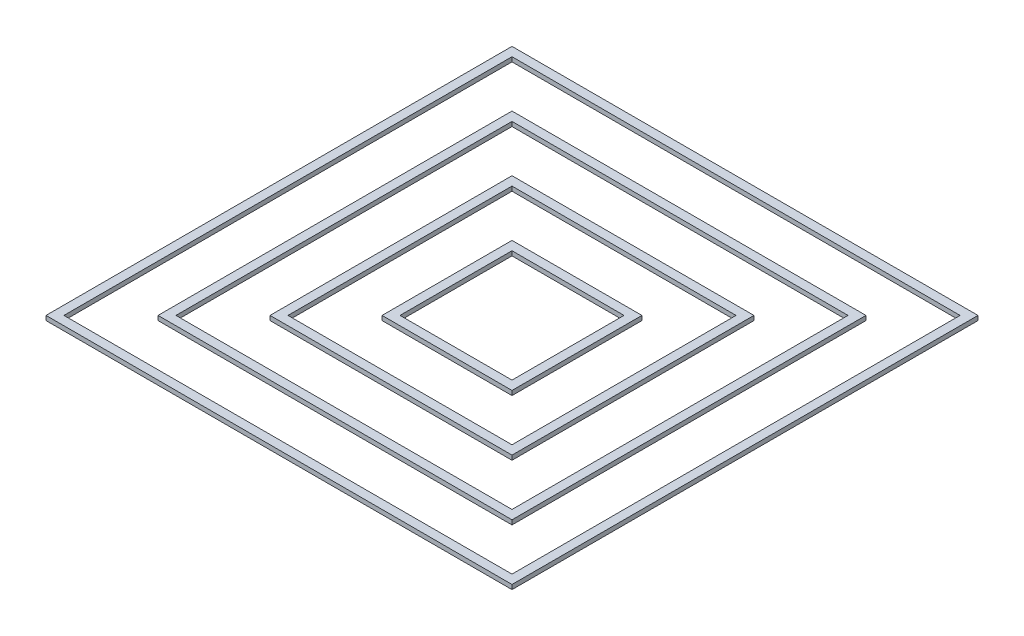
ISO-10303-21;
HEADER;
FILE_DESCRIPTION(('STEP AP214'),'2;1');
FILE_NAME('part.step','',(''),(''),'','','');
FILE_SCHEMA(('AUTOMOTIVE_DESIGN { 1 0 10303 214 1 1 1 1 }'));
ENDSEC;
DATA;
#1=APPLICATION_CONTEXT('core data for automotive mechanical design processes');
#2=APPLICATION_PROTOCOL_DEFINITION('international standard','automotive_design',2000,#1);
#3=PRODUCT_CONTEXT('',#1,'mechanical');
#4=PRODUCT('Part','Part','',(#3));
#5=PRODUCT_RELATED_PRODUCT_CATEGORY('part','',(#4));
#6=PRODUCT_DEFINITION_FORMATION('','',#4);
#7=PRODUCT_DEFINITION_CONTEXT('part definition',#1,'design');
#8=PRODUCT_DEFINITION('design','',#6,#7);
#9=PRODUCT_DEFINITION_SHAPE('','',#8);
#10=(LENGTH_UNIT() NAMED_UNIT(*) SI_UNIT(.MILLI.,.METRE.));
#11=(NAMED_UNIT(*) PLANE_ANGLE_UNIT() SI_UNIT($,.RADIAN.));
#12=(NAMED_UNIT(*) SI_UNIT($,.STERADIAN.) SOLID_ANGLE_UNIT());
#13=UNCERTAINTY_MEASURE_WITH_UNIT(LENGTH_MEASURE(1.E-05),#10,'distance_accuracy_value','');
#14=(GEOMETRIC_REPRESENTATION_CONTEXT(3) GLOBAL_UNCERTAINTY_ASSIGNED_CONTEXT((#13)) GLOBAL_UNIT_ASSIGNED_CONTEXT((#10,
#11,#12)) REPRESENTATION_CONTEXT('',''));
#15=CARTESIAN_POINT('',(0.,0.,0.));
#16=DIRECTION('',(0.,0.,1.));
#17=DIRECTION('',(1.,0.,0.));
#18=AXIS2_PLACEMENT_3D('',#15,#16,#17);
#19=CARTESIAN_POINT('',(0.,2.,0.));
#20=DIRECTION('',(0.,1.,0.));
#21=DIRECTION('',(0.,0.,1.));
#22=AXIS2_PLACEMENT_3D('',#19,#20,#21);
#23=PLANE('',#22);
#24=DIRECTION('',(0.,0.,1.));
#25=VECTOR('',#24,1.);
#26=CARTESIAN_POINT('',(-14.8676207513417,2.,15.4293381037567));
#27=LINE('',#26,#25);
#28=CARTESIAN_POINT('',(-14.8676207513417,2.,11.4293381037567));
#29=VERTEX_POINT('',#28);
#30=CARTESIAN_POINT('',(-14.8676207513417,2.,69.4293381037567));
#31=VERTEX_POINT('',#30);
#32=EDGE_CURVE('E825',#29,#31,#27,.T.);
#33=ORIENTED_EDGE('',*,*,#32,.T.);
#34=DIRECTION('',(1.,0.,0.));
#35=VECTOR('',#34,1.);
#36=CARTESIAN_POINT('',(-10.8676207513417,2.,69.4293381037567));
#37=LINE('',#36,#35);
#38=CARTESIAN_POINT('',(43.1323792486584,2.,69.4293381037567));
#39=VERTEX_POINT('',#38);
#40=EDGE_CURVE('E829',#31,#39,#37,.T.);
#41=ORIENTED_EDGE('',*,*,#40,.T.);
#42=DIRECTION('',(0.,0.,1.));
#43=VECTOR('',#42,1.);
#44=CARTESIAN_POINT('',(43.1323792486583,2.,15.4293381037567));
#45=LINE('',#44,#43);
#46=CARTESIAN_POINT('',(43.1323792486583,2.,11.4293381037567));
#47=VERTEX_POINT('',#46);
#48=EDGE_CURVE('E831',#47,#39,#45,.T.);
#49=ORIENTED_EDGE('',*,*,#48,.F.);
#50=DIRECTION('',(1.,0.,0.));
#51=VECTOR('',#50,1.);
#52=CARTESIAN_POINT('',(-10.8676207513417,2.,11.4293381037567));
#53=LINE('',#52,#51);
#54=EDGE_CURVE('E834',#29,#47,#53,.T.);
#55=ORIENTED_EDGE('',*,*,#54,.F.);
#56=EDGE_LOOP('',(#33,#41,#49,#55));
#57=FACE_BOUND('',#56,.T.);
#58=DIRECTION('',(1.,0.,0.));
#59=VECTOR('',#58,1.);
#60=CARTESIAN_POINT('',(-10.8676207513417,2.,65.4293381037567));
#61=LINE('',#60,#59);
#62=CARTESIAN_POINT('',(-10.8676207513417,2.,65.4293381037567));
#63=VERTEX_POINT('',#62);
#64=CARTESIAN_POINT('',(39.1323792486583,2.,65.4293381037567));
#65=VERTEX_POINT('',#64);
#66=EDGE_CURVE('E752',#63,#65,#61,.T.);
#67=ORIENTED_EDGE('',*,*,#66,.F.);
#68=DIRECTION('',(0.,0.,1.));
#69=VECTOR('',#68,1.);
#70=CARTESIAN_POINT('',(-10.8676207513417,2.,15.4293381037567));
#71=LINE('',#70,#69);
#72=CARTESIAN_POINT('',(-10.8676207513417,2.,15.4293381037567));
#73=VERTEX_POINT('',#72);
#74=EDGE_CURVE('E726',#73,#63,#71,.T.);
#75=ORIENTED_EDGE('',*,*,#74,.F.);
#76=DIRECTION('',(1.,0.,0.));
#77=VECTOR('',#76,1.);
#78=CARTESIAN_POINT('',(-10.8676207513417,2.,15.4293381037567));
#79=LINE('',#78,#77);
#80=CARTESIAN_POINT('',(39.1323792486583,2.,15.4293381037567));
#81=VERTEX_POINT('',#80);
#82=EDGE_CURVE('E798',#73,#81,#79,.T.);
#83=ORIENTED_EDGE('',*,*,#82,.T.);
#84=DIRECTION('',(0.,0.,1.));
#85=VECTOR('',#84,1.);
#86=CARTESIAN_POINT('',(39.1323792486583,2.,15.4293381037567));
#87=LINE('',#86,#85);
#88=EDGE_CURVE('E793',#81,#65,#87,.T.);
#89=ORIENTED_EDGE('',*,*,#88,.T.);
#90=EDGE_LOOP('',(#67,#75,#83,#89));
#91=FACE_BOUND('',#90,.T.);
#92=ADVANCED_FACE('F722',(#57,#91),#23,.T.);
#93=CARTESIAN_POINT('',(0.,0.,0.));
#94=DIRECTION('',(0.,1.,0.));
#95=DIRECTION('',(0.,0.,1.));
#96=AXIS2_PLACEMENT_3D('',#93,#94,#95);
#97=PLANE('',#96);
#98=DIRECTION('',(0.,0.,1.));
#99=VECTOR('',#98,1.);
#100=CARTESIAN_POINT('',(-14.8676207513417,0.,15.4293381037567));
#101=LINE('',#100,#99);
#102=CARTESIAN_POINT('',(-14.8676207513417,0.,11.4293381037567));
#103=VERTEX_POINT('',#102);
#104=CARTESIAN_POINT('',(-14.8676207513417,0.,69.4293381037567));
#105=VERTEX_POINT('',#104);
#106=EDGE_CURVE('E818',#103,#105,#101,.T.);
#107=ORIENTED_EDGE('',*,*,#106,.F.);
#108=DIRECTION('',(1.,0.,0.));
#109=VECTOR('',#108,1.);
#110=CARTESIAN_POINT('',(-10.8676207513417,0.,11.4293381037567));
#111=LINE('',#110,#109);
#112=CARTESIAN_POINT('',(43.1323792486583,0.,11.4293381037567));
#113=VERTEX_POINT('',#112);
#114=EDGE_CURVE('E828',#103,#113,#111,.T.);
#115=ORIENTED_EDGE('',*,*,#114,.T.);
#116=DIRECTION('',(0.,0.,1.));
#117=VECTOR('',#116,1.);
#118=CARTESIAN_POINT('',(43.1323792486583,0.,15.4293381037567));
#119=LINE('',#118,#117);
#120=CARTESIAN_POINT('',(43.1323792486584,0.,69.4293381037567));
#121=VERTEX_POINT('',#120);
#122=EDGE_CURVE('E840',#113,#121,#119,.T.);
#123=ORIENTED_EDGE('',*,*,#122,.T.);
#124=DIRECTION('',(1.,0.,0.));
#125=VECTOR('',#124,1.);
#126=CARTESIAN_POINT('',(-10.8676207513417,0.,69.4293381037567));
#127=LINE('',#126,#125);
#128=EDGE_CURVE('E822',#105,#121,#127,.T.);
#129=ORIENTED_EDGE('',*,*,#128,.F.);
#130=EDGE_LOOP('',(#107,#115,#123,#129));
#131=FACE_BOUND('',#130,.T.);
#132=DIRECTION('',(0.,0.,1.));
#133=VECTOR('',#132,1.);
#134=CARTESIAN_POINT('',(-10.8676207513417,0.,15.4293381037567));
#135=LINE('',#134,#133);
#136=CARTESIAN_POINT('',(-10.8676207513417,0.,15.4293381037567));
#137=VERTEX_POINT('',#136);
#138=CARTESIAN_POINT('',(-10.8676207513417,0.,65.4293381037567));
#139=VERTEX_POINT('',#138);
#140=EDGE_CURVE('E13',#137,#139,#135,.T.);
#141=ORIENTED_EDGE('',*,*,#140,.T.);
#142=DIRECTION('',(1.,0.,0.));
#143=VECTOR('',#142,1.);
#144=CARTESIAN_POINT('',(-10.8676207513417,0.,65.4293381037567));
#145=LINE('',#144,#143);
#146=CARTESIAN_POINT('',(39.1323792486583,0.,65.4293381037567));
#147=VERTEX_POINT('',#146);
#148=EDGE_CURVE('E732',#139,#147,#145,.T.);
#149=ORIENTED_EDGE('',*,*,#148,.T.);
#150=DIRECTION('',(0.,0.,1.));
#151=VECTOR('',#150,1.);
#152=CARTESIAN_POINT('',(39.1323792486583,0.,15.4293381037567));
#153=LINE('',#152,#151);
#154=CARTESIAN_POINT('',(39.1323792486583,0.,15.4293381037567));
#155=VERTEX_POINT('',#154);
#156=EDGE_CURVE('E811',#155,#147,#153,.T.);
#157=ORIENTED_EDGE('',*,*,#156,.F.);
#158=DIRECTION('',(1.,0.,0.));
#159=VECTOR('',#158,1.);
#160=CARTESIAN_POINT('',(-10.8676207513417,0.,15.4293381037567));
#161=LINE('',#160,#159);
#162=EDGE_CURVE('E804',#137,#155,#161,.T.);
#163=ORIENTED_EDGE('',*,*,#162,.F.);
#164=EDGE_LOOP('',(#141,#149,#157,#163));
#165=FACE_BOUND('',#164,.T.);
#166=ADVANCED_FACE('F815',(#131,#165),#97,.F.);
#167=CARTESIAN_POINT('',(-14.8676207513417,2.,15.4293381037567));
#168=DIRECTION('',(1.,0.,0.));
#169=DIRECTION('',(0.,0.,-1.));
#170=AXIS2_PLACEMENT_3D('',#167,#168,#169);
#171=PLANE('',#170);
#172=ORIENTED_EDGE('',*,*,#106,.T.);
#173=DIRECTION('',(0.,-1.,0.));
#174=VECTOR('',#173,1.);
#175=CARTESIAN_POINT('',(-14.8676207513417,2.,69.4293381037567));
#176=LINE('',#175,#174);
#177=EDGE_CURVE('E850',#31,#105,#176,.T.);
#178=ORIENTED_EDGE('',*,*,#177,.F.);
#179=ORIENTED_EDGE('',*,*,#32,.F.);
#180=DIRECTION('',(0.,-1.,0.));
#181=VECTOR('',#180,1.);
#182=CARTESIAN_POINT('',(-14.8676207513417,2.,11.4293381037567));
#183=LINE('',#182,#181);
#184=EDGE_CURVE('E836',#29,#103,#183,.T.);
#185=ORIENTED_EDGE('',*,*,#184,.T.);
#186=EDGE_LOOP('',(#172,#178,#179,#185));
#187=FACE_BOUND('',#186,.T.);
#188=ADVANCED_FACE('F859',(#187),#171,.F.);
#189=CARTESIAN_POINT('',(-10.8676207513417,2.,69.4293381037567));
#190=DIRECTION('',(0.,0.,-1.));
#191=DIRECTION('',(-1.,0.,0.));
#192=AXIS2_PLACEMENT_3D('',#189,#190,#191);
#193=PLANE('',#192);
#194=ORIENTED_EDGE('',*,*,#128,.T.);
#195=DIRECTION('',(0.,-1.,0.));
#196=VECTOR('',#195,1.);
#197=CARTESIAN_POINT('',(43.1323792486584,2.,69.4293381037567));
#198=LINE('',#197,#196);
#199=EDGE_CURVE('E848',#39,#121,#198,.T.);
#200=ORIENTED_EDGE('',*,*,#199,.F.);
#201=ORIENTED_EDGE('',*,*,#40,.F.);
#202=ORIENTED_EDGE('',*,*,#177,.T.);
#203=EDGE_LOOP('',(#194,#200,#201,#202));
#204=FACE_BOUND('',#203,.T.);
#205=ADVANCED_FACE('F854',(#204),#193,.F.);
#206=CARTESIAN_POINT('',(43.1323792486583,2.,15.4293381037567));
#207=DIRECTION('',(1.,0.,0.));
#208=DIRECTION('',(0.,0.,-1.));
#209=AXIS2_PLACEMENT_3D('',#206,#207,#208);
#210=PLANE('',#209);
#211=ORIENTED_EDGE('',*,*,#122,.F.);
#212=DIRECTION('',(0.,-1.,0.));
#213=VECTOR('',#212,1.);
#214=CARTESIAN_POINT('',(43.1323792486583,2.,11.4293381037567));
#215=LINE('',#214,#213);
#216=EDGE_CURVE('E846',#47,#113,#215,.T.);
#217=ORIENTED_EDGE('',*,*,#216,.F.);
#218=ORIENTED_EDGE('',*,*,#48,.T.);
#219=ORIENTED_EDGE('',*,*,#199,.T.);
#220=EDGE_LOOP('',(#211,#217,#218,#219));
#221=FACE_BOUND('',#220,.T.);
#222=ADVANCED_FACE('F868',(#221),#210,.T.);
#223=CARTESIAN_POINT('',(-10.8676207513417,2.,11.4293381037567));
#224=DIRECTION('',(0.,0.,-1.));
#225=DIRECTION('',(-1.,0.,0.));
#226=AXIS2_PLACEMENT_3D('',#223,#224,#225);
#227=PLANE('',#226);
#228=ORIENTED_EDGE('',*,*,#114,.F.);
#229=ORIENTED_EDGE('',*,*,#184,.F.);
#230=ORIENTED_EDGE('',*,*,#54,.T.);
#231=ORIENTED_EDGE('',*,*,#216,.T.);
#232=EDGE_LOOP('',(#228,#229,#230,#231));
#233=FACE_BOUND('',#232,.T.);
#234=ADVANCED_FACE('F863',(#233),#227,.T.);
#235=CARTESIAN_POINT('',(-10.8676207513417,2.,15.4293381037567));
#236=DIRECTION('',(1.,0.,0.));
#237=DIRECTION('',(0.,0.,-1.));
#238=AXIS2_PLACEMENT_3D('',#235,#236,#237);
#239=PLANE('',#238);
#240=ORIENTED_EDGE('',*,*,#140,.F.);
#241=DIRECTION('',(0.,-1.,0.));
#242=VECTOR('',#241,1.);
#243=CARTESIAN_POINT('',(-10.8676207513417,2.,15.4293381037567));
#244=LINE('',#243,#242);
#245=EDGE_CURVE('E806',#73,#137,#244,.T.);
#246=ORIENTED_EDGE('',*,*,#245,.F.);
#247=ORIENTED_EDGE('',*,*,#74,.T.);
#248=DIRECTION('',(0.,-1.,0.));
#249=VECTOR('',#248,1.);
#250=CARTESIAN_POINT('',(-10.8676207513417,2.,65.4293381037567));
#251=LINE('',#250,#249);
#252=EDGE_CURVE('E817',#63,#139,#251,.T.);
#253=ORIENTED_EDGE('',*,*,#252,.T.);
#254=EDGE_LOOP('',(#240,#246,#247,#253));
#255=FACE_BOUND('',#254,.T.);
#256=ADVANCED_FACE('F816',(#255),#239,.T.);
#257=CARTESIAN_POINT('',(-10.8676207513417,2.,65.4293381037567));
#258=DIRECTION('',(0.,0.,-1.));
#259=DIRECTION('',(-1.,0.,0.));
#260=AXIS2_PLACEMENT_3D('',#257,#258,#259);
#261=PLANE('',#260);
#262=ORIENTED_EDGE('',*,*,#148,.F.);
#263=ORIENTED_EDGE('',*,*,#252,.F.);
#264=ORIENTED_EDGE('',*,*,#66,.T.);
#265=DIRECTION('',(0.,-1.,0.));
#266=VECTOR('',#265,1.);
#267=CARTESIAN_POINT('',(39.1323792486583,2.,65.4293381037567));
#268=LINE('',#267,#266);
#269=EDGE_CURVE('E795',#65,#147,#268,.T.);
#270=ORIENTED_EDGE('',*,*,#269,.T.);
#271=EDGE_LOOP('',(#262,#263,#264,#270));
#272=FACE_BOUND('',#271,.T.);
#273=ADVANCED_FACE('F880',(#272),#261,.T.);
#274=CARTESIAN_POINT('',(39.1323792486583,2.,15.4293381037567));
#275=DIRECTION('',(1.,0.,0.));
#276=DIRECTION('',(0.,0.,-1.));
#277=AXIS2_PLACEMENT_3D('',#274,#275,#276);
#278=PLANE('',#277);
#279=ORIENTED_EDGE('',*,*,#156,.T.);
#280=ORIENTED_EDGE('',*,*,#269,.F.);
#281=ORIENTED_EDGE('',*,*,#88,.F.);
#282=DIRECTION('',(0.,-1.,0.));
#283=VECTOR('',#282,1.);
#284=CARTESIAN_POINT('',(39.1323792486583,2.,15.4293381037567));
#285=LINE('',#284,#283);
#286=EDGE_CURVE('E762',#81,#155,#285,.T.);
#287=ORIENTED_EDGE('',*,*,#286,.T.);
#288=EDGE_LOOP('',(#279,#280,#281,#287));
#289=FACE_BOUND('',#288,.T.);
#290=ADVANCED_FACE('F794',(#289),#278,.F.);
#291=CARTESIAN_POINT('',(-10.8676207513417,2.,15.4293381037567));
#292=DIRECTION('',(0.,0.,-1.));
#293=DIRECTION('',(-1.,0.,0.));
#294=AXIS2_PLACEMENT_3D('',#291,#292,#293);
#295=PLANE('',#294);
#296=ORIENTED_EDGE('',*,*,#162,.T.);
#297=ORIENTED_EDGE('',*,*,#286,.F.);
#298=ORIENTED_EDGE('',*,*,#82,.F.);
#299=ORIENTED_EDGE('',*,*,#245,.T.);
#300=EDGE_LOOP('',(#296,#297,#298,#299));
#301=FACE_BOUND('',#300,.T.);
#302=ADVANCED_FACE('F724',(#301),#295,.F.);
#303=CLOSED_SHELL('',(#92,#166,#188,#205,#222,#234,#256,#273,#290,#302));
#304=MANIFOLD_SOLID_BREP('B2',#303);
#305=CARTESIAN_POINT('',(0.,2.,0.));
#306=DIRECTION('',(0.,1.,0.));
#307=DIRECTION('',(0.,0.,1.));
#308=AXIS2_PLACEMENT_3D('',#305,#306,#307);
#309=PLANE('',#308);
#310=DIRECTION('',(0.,0.,1.));
#311=VECTOR('',#310,1.);
#312=CARTESIAN_POINT('',(-39.8676207513417,2.,-9.57066189624328));
#313=LINE('',#312,#311);
#314=CARTESIAN_POINT('',(-39.8676207513417,2.,-13.5706618962433));
#315=VERTEX_POINT('',#314);
#316=CARTESIAN_POINT('',(-39.8676207513416,2.,94.4293381037567));
#317=VERTEX_POINT('',#316);
#318=EDGE_CURVE('E1065',#315,#317,#313,.T.);
#319=ORIENTED_EDGE('',*,*,#318,.T.);
#320=DIRECTION('',(1.,0.,0.));
#321=VECTOR('',#320,1.);
#322=CARTESIAN_POINT('',(-35.8676207513416,2.,94.4293381037567));
#323=LINE('',#322,#321);
#324=CARTESIAN_POINT('',(68.1323792486584,2.,94.4293381037567));
#325=VERTEX_POINT('',#324);
#326=EDGE_CURVE('E1069',#317,#325,#323,.T.);
#327=ORIENTED_EDGE('',*,*,#326,.T.);
#328=DIRECTION('',(0.,0.,1.));
#329=VECTOR('',#328,1.);
#330=CARTESIAN_POINT('',(68.1323792486584,2.,-9.57066189624328));
#331=LINE('',#330,#329);
#332=CARTESIAN_POINT('',(68.1323792486584,2.,-13.5706618962433));
#333=VERTEX_POINT('',#332);
#334=EDGE_CURVE('E1071',#333,#325,#331,.T.);
#335=ORIENTED_EDGE('',*,*,#334,.F.);
#336=DIRECTION('',(1.,0.,0.));
#337=VECTOR('',#336,1.);
#338=CARTESIAN_POINT('',(-35.8676207513417,2.,-13.5706618962433));
#339=LINE('',#338,#337);
#340=EDGE_CURVE('E1074',#315,#333,#339,.T.);
#341=ORIENTED_EDGE('',*,*,#340,.F.);
#342=EDGE_LOOP('',(#319,#327,#335,#341));
#343=FACE_BOUND('',#342,.T.);
#344=DIRECTION('',(1.,0.,0.));
#345=VECTOR('',#344,1.);
#346=CARTESIAN_POINT('',(-35.8676207513416,2.,90.4293381037567));
#347=LINE('',#346,#345);
#348=CARTESIAN_POINT('',(-35.8676207513416,2.,90.4293381037567));
#349=VERTEX_POINT('',#348);
#350=CARTESIAN_POINT('',(64.1323792486584,2.,90.4293381037567));
#351=VERTEX_POINT('',#350);
#352=EDGE_CURVE('E992',#349,#351,#347,.T.);
#353=ORIENTED_EDGE('',*,*,#352,.F.);
#354=DIRECTION('',(0.,0.,1.));
#355=VECTOR('',#354,1.);
#356=CARTESIAN_POINT('',(-35.8676207513417,2.,-9.57066189624328));
#357=LINE('',#356,#355);
#358=CARTESIAN_POINT('',(-35.8676207513417,2.,-9.57066189624328));
#359=VERTEX_POINT('',#358);
#360=EDGE_CURVE('E966',#359,#349,#357,.T.);
#361=ORIENTED_EDGE('',*,*,#360,.F.);
#362=DIRECTION('',(1.,0.,0.));
#363=VECTOR('',#362,1.);
#364=CARTESIAN_POINT('',(-35.8676207513417,2.,-9.57066189624328));
#365=LINE('',#364,#363);
#366=CARTESIAN_POINT('',(64.1323792486584,2.,-9.57066189624328));
#367=VERTEX_POINT('',#366);
#368=EDGE_CURVE('E1038',#359,#367,#365,.T.);
#369=ORIENTED_EDGE('',*,*,#368,.T.);
#370=DIRECTION('',(0.,0.,1.));
#371=VECTOR('',#370,1.);
#372=CARTESIAN_POINT('',(64.1323792486584,2.,-9.57066189624328));
#373=LINE('',#372,#371);
#374=EDGE_CURVE('E1033',#367,#351,#373,.T.);
#375=ORIENTED_EDGE('',*,*,#374,.T.);
#376=EDGE_LOOP('',(#353,#361,#369,#375));
#377=FACE_BOUND('',#376,.T.);
#378=ADVANCED_FACE('F962',(#343,#377),#309,.T.);
#379=CARTESIAN_POINT('',(0.,0.,0.));
#380=DIRECTION('',(0.,1.,0.));
#381=DIRECTION('',(0.,0.,1.));
#382=AXIS2_PLACEMENT_3D('',#379,#380,#381);
#383=PLANE('',#382);
#384=DIRECTION('',(0.,0.,1.));
#385=VECTOR('',#384,1.);
#386=CARTESIAN_POINT('',(-39.8676207513417,0.,-9.57066189624328));
#387=LINE('',#386,#385);
#388=CARTESIAN_POINT('',(-39.8676207513417,0.,-13.5706618962433));
#389=VERTEX_POINT('',#388);
#390=CARTESIAN_POINT('',(-39.8676207513416,0.,94.4293381037567));
#391=VERTEX_POINT('',#390);
#392=EDGE_CURVE('E1058',#389,#391,#387,.T.);
#393=ORIENTED_EDGE('',*,*,#392,.F.);
#394=DIRECTION('',(1.,0.,0.));
#395=VECTOR('',#394,1.);
#396=CARTESIAN_POINT('',(-35.8676207513417,0.,-13.5706618962433));
#397=LINE('',#396,#395);
#398=CARTESIAN_POINT('',(68.1323792486584,0.,-13.5706618962433));
#399=VERTEX_POINT('',#398);
#400=EDGE_CURVE('E1068',#389,#399,#397,.T.);
#401=ORIENTED_EDGE('',*,*,#400,.T.);
#402=DIRECTION('',(0.,0.,1.));
#403=VECTOR('',#402,1.);
#404=CARTESIAN_POINT('',(68.1323792486584,0.,-9.57066189624328));
#405=LINE('',#404,#403);
#406=CARTESIAN_POINT('',(68.1323792486584,0.,94.4293381037567));
#407=VERTEX_POINT('',#406);
#408=EDGE_CURVE('E1080',#399,#407,#405,.T.);
#409=ORIENTED_EDGE('',*,*,#408,.T.);
#410=DIRECTION('',(1.,0.,0.));
#411=VECTOR('',#410,1.);
#412=CARTESIAN_POINT('',(-35.8676207513416,0.,94.4293381037567));
#413=LINE('',#412,#411);
#414=EDGE_CURVE('E1062',#391,#407,#413,.T.);
#415=ORIENTED_EDGE('',*,*,#414,.F.);
#416=EDGE_LOOP('',(#393,#401,#409,#415));
#417=FACE_BOUND('',#416,.T.);
#418=DIRECTION('',(0.,0.,1.));
#419=VECTOR('',#418,1.);
#420=CARTESIAN_POINT('',(-35.8676207513417,0.,-9.57066189624328));
#421=LINE('',#420,#419);
#422=CARTESIAN_POINT('',(-35.8676207513417,0.,-9.57066189624328));
#423=VERTEX_POINT('',#422);
#424=CARTESIAN_POINT('',(-35.8676207513416,0.,90.4293381037567));
#425=VERTEX_POINT('',#424);
#426=EDGE_CURVE('E720',#423,#425,#421,.T.);
#427=ORIENTED_EDGE('',*,*,#426,.T.);
#428=DIRECTION('',(1.,0.,0.));
#429=VECTOR('',#428,1.);
#430=CARTESIAN_POINT('',(-35.8676207513416,0.,90.4293381037567));
#431=LINE('',#430,#429);
#432=CARTESIAN_POINT('',(64.1323792486584,0.,90.4293381037567));
#433=VERTEX_POINT('',#432);
#434=EDGE_CURVE('E972',#425,#433,#431,.T.);
#435=ORIENTED_EDGE('',*,*,#434,.T.);
#436=DIRECTION('',(0.,0.,1.));
#437=VECTOR('',#436,1.);
#438=CARTESIAN_POINT('',(64.1323792486584,0.,-9.57066189624328));
#439=LINE('',#438,#437);
#440=CARTESIAN_POINT('',(64.1323792486584,0.,-9.57066189624328));
#441=VERTEX_POINT('',#440);
#442=EDGE_CURVE('E1051',#441,#433,#439,.T.);
#443=ORIENTED_EDGE('',*,*,#442,.F.);
#444=DIRECTION('',(1.,0.,0.));
#445=VECTOR('',#444,1.);
#446=CARTESIAN_POINT('',(-35.8676207513417,0.,-9.57066189624328));
#447=LINE('',#446,#445);
#448=EDGE_CURVE('E1044',#423,#441,#447,.T.);
#449=ORIENTED_EDGE('',*,*,#448,.F.);
#450=EDGE_LOOP('',(#427,#435,#443,#449));
#451=FACE_BOUND('',#450,.T.);
#452=ADVANCED_FACE('F1055',(#417,#451),#383,.F.);
#453=CARTESIAN_POINT('',(-39.8676207513417,2.,-9.57066189624328));
#454=DIRECTION('',(1.,0.,0.));
#455=DIRECTION('',(0.,0.,-1.));
#456=AXIS2_PLACEMENT_3D('',#453,#454,#455);
#457=PLANE('',#456);
#458=ORIENTED_EDGE('',*,*,#392,.T.);
#459=DIRECTION('',(0.,-1.,0.));
#460=VECTOR('',#459,1.);
#461=CARTESIAN_POINT('',(-39.8676207513416,2.,94.4293381037567));
#462=LINE('',#461,#460);
#463=EDGE_CURVE('E1090',#317,#391,#462,.T.);
#464=ORIENTED_EDGE('',*,*,#463,.F.);
#465=ORIENTED_EDGE('',*,*,#318,.F.);
#466=DIRECTION('',(0.,-1.,0.));
#467=VECTOR('',#466,1.);
#468=CARTESIAN_POINT('',(-39.8676207513417,2.,-13.5706618962433));
#469=LINE('',#468,#467);
#470=EDGE_CURVE('E1076',#315,#389,#469,.T.);
#471=ORIENTED_EDGE('',*,*,#470,.T.);
#472=EDGE_LOOP('',(#458,#464,#465,#471));
#473=FACE_BOUND('',#472,.T.);
#474=ADVANCED_FACE('F1099',(#473),#457,.F.);
#475=CARTESIAN_POINT('',(-35.8676207513416,2.,94.4293381037567));
#476=DIRECTION('',(0.,0.,-1.));
#477=DIRECTION('',(-1.,0.,0.));
#478=AXIS2_PLACEMENT_3D('',#475,#476,#477);
#479=PLANE('',#478);
#480=ORIENTED_EDGE('',*,*,#414,.T.);
#481=DIRECTION('',(0.,-1.,0.));
#482=VECTOR('',#481,1.);
#483=CARTESIAN_POINT('',(68.1323792486584,2.,94.4293381037567));
#484=LINE('',#483,#482);
#485=EDGE_CURVE('E1088',#325,#407,#484,.T.);
#486=ORIENTED_EDGE('',*,*,#485,.F.);
#487=ORIENTED_EDGE('',*,*,#326,.F.);
#488=ORIENTED_EDGE('',*,*,#463,.T.);
#489=EDGE_LOOP('',(#480,#486,#487,#488));
#490=FACE_BOUND('',#489,.T.);
#491=ADVANCED_FACE('F1094',(#490),#479,.F.);
#492=CARTESIAN_POINT('',(68.1323792486584,2.,-9.57066189624328));
#493=DIRECTION('',(1.,0.,0.));
#494=DIRECTION('',(0.,0.,-1.));
#495=AXIS2_PLACEMENT_3D('',#492,#493,#494);
#496=PLANE('',#495);
#497=ORIENTED_EDGE('',*,*,#408,.F.);
#498=DIRECTION('',(0.,-1.,0.));
#499=VECTOR('',#498,1.);
#500=CARTESIAN_POINT('',(68.1323792486584,2.,-13.5706618962433));
#501=LINE('',#500,#499);
#502=EDGE_CURVE('E1086',#333,#399,#501,.T.);
#503=ORIENTED_EDGE('',*,*,#502,.F.);
#504=ORIENTED_EDGE('',*,*,#334,.T.);
#505=ORIENTED_EDGE('',*,*,#485,.T.);
#506=EDGE_LOOP('',(#497,#503,#504,#505));
#507=FACE_BOUND('',#506,.T.);
#508=ADVANCED_FACE('F1108',(#507),#496,.T.);
#509=CARTESIAN_POINT('',(-35.8676207513417,2.,-13.5706618962433));
#510=DIRECTION('',(0.,0.,-1.));
#511=DIRECTION('',(-1.,0.,0.));
#512=AXIS2_PLACEMENT_3D('',#509,#510,#511);
#513=PLANE('',#512);
#514=ORIENTED_EDGE('',*,*,#400,.F.);
#515=ORIENTED_EDGE('',*,*,#470,.F.);
#516=ORIENTED_EDGE('',*,*,#340,.T.);
#517=ORIENTED_EDGE('',*,*,#502,.T.);
#518=EDGE_LOOP('',(#514,#515,#516,#517));
#519=FACE_BOUND('',#518,.T.);
#520=ADVANCED_FACE('F1103',(#519),#513,.T.);
#521=CARTESIAN_POINT('',(-35.8676207513417,2.,-9.57066189624328));
#522=DIRECTION('',(1.,0.,0.));
#523=DIRECTION('',(0.,0.,-1.));
#524=AXIS2_PLACEMENT_3D('',#521,#522,#523);
#525=PLANE('',#524);
#526=ORIENTED_EDGE('',*,*,#426,.F.);
#527=DIRECTION('',(0.,-1.,0.));
#528=VECTOR('',#527,1.);
#529=CARTESIAN_POINT('',(-35.8676207513417,2.,-9.57066189624328));
#530=LINE('',#529,#528);
#531=EDGE_CURVE('E1046',#359,#423,#530,.T.);
#532=ORIENTED_EDGE('',*,*,#531,.F.);
#533=ORIENTED_EDGE('',*,*,#360,.T.);
#534=DIRECTION('',(0.,-1.,0.));
#535=VECTOR('',#534,1.);
#536=CARTESIAN_POINT('',(-35.8676207513416,2.,90.4293381037567));
#537=LINE('',#536,#535);
#538=EDGE_CURVE('E1057',#349,#425,#537,.T.);
#539=ORIENTED_EDGE('',*,*,#538,.T.);
#540=EDGE_LOOP('',(#526,#532,#533,#539));
#541=FACE_BOUND('',#540,.T.);
#542=ADVANCED_FACE('F1056',(#541),#525,.T.);
#543=CARTESIAN_POINT('',(-35.8676207513416,2.,90.4293381037567));
#544=DIRECTION('',(0.,0.,-1.));
#545=DIRECTION('',(-1.,0.,0.));
#546=AXIS2_PLACEMENT_3D('',#543,#544,#545);
#547=PLANE('',#546);
#548=ORIENTED_EDGE('',*,*,#434,.F.);
#549=ORIENTED_EDGE('',*,*,#538,.F.);
#550=ORIENTED_EDGE('',*,*,#352,.T.);
#551=DIRECTION('',(0.,-1.,0.));
#552=VECTOR('',#551,1.);
#553=CARTESIAN_POINT('',(64.1323792486584,2.,90.4293381037567));
#554=LINE('',#553,#552);
#555=EDGE_CURVE('E1035',#351,#433,#554,.T.);
#556=ORIENTED_EDGE('',*,*,#555,.T.);
#557=EDGE_LOOP('',(#548,#549,#550,#556));
#558=FACE_BOUND('',#557,.T.);
#559=ADVANCED_FACE('F1120',(#558),#547,.T.);
#560=CARTESIAN_POINT('',(64.1323792486584,2.,-9.57066189624328));
#561=DIRECTION('',(1.,0.,0.));
#562=DIRECTION('',(0.,0.,-1.));
#563=AXIS2_PLACEMENT_3D('',#560,#561,#562);
#564=PLANE('',#563);
#565=ORIENTED_EDGE('',*,*,#442,.T.);
#566=ORIENTED_EDGE('',*,*,#555,.F.);
#567=ORIENTED_EDGE('',*,*,#374,.F.);
#568=DIRECTION('',(0.,-1.,0.));
#569=VECTOR('',#568,1.);
#570=CARTESIAN_POINT('',(64.1323792486584,2.,-9.57066189624328));
#571=LINE('',#570,#569);
#572=EDGE_CURVE('E1002',#367,#441,#571,.T.);
#573=ORIENTED_EDGE('',*,*,#572,.T.);
#574=EDGE_LOOP('',(#565,#566,#567,#573));
#575=FACE_BOUND('',#574,.T.);
#576=ADVANCED_FACE('F1034',(#575),#564,.F.);
#577=CARTESIAN_POINT('',(-35.8676207513417,2.,-9.57066189624328));
#578=DIRECTION('',(0.,0.,-1.));
#579=DIRECTION('',(-1.,0.,0.));
#580=AXIS2_PLACEMENT_3D('',#577,#578,#579);
#581=PLANE('',#580);
#582=ORIENTED_EDGE('',*,*,#448,.T.);
#583=ORIENTED_EDGE('',*,*,#572,.F.);
#584=ORIENTED_EDGE('',*,*,#368,.F.);
#585=ORIENTED_EDGE('',*,*,#531,.T.);
#586=EDGE_LOOP('',(#582,#583,#584,#585));
#587=FACE_BOUND('',#586,.T.);
#588=ADVANCED_FACE('F964',(#587),#581,.F.);
#589=CLOSED_SHELL('',(#378,#452,#474,#491,#508,#520,#542,#559,#576,#588));
#590=MANIFOLD_SOLID_BREP('B7',#589);
#591=CARTESIAN_POINT('',(0.,2.,0.));
#592=DIRECTION('',(0.,1.,0.));
#593=DIRECTION('',(0.,0.,1.));
#594=AXIS2_PLACEMENT_3D('',#591,#592,#593);
#595=PLANE('',#594);
#596=DIRECTION('',(0.,0.,1.));
#597=VECTOR('',#596,1.);
#598=CARTESIAN_POINT('',(-64.8676207513417,2.,-34.5706618962433));
#599=LINE('',#598,#597);
#600=CARTESIAN_POINT('',(-64.8676207513417,2.,-38.5706618962433));
#601=VERTEX_POINT('',#600);
#602=CARTESIAN_POINT('',(-64.8676207513416,2.,119.429338103757));
#603=VERTEX_POINT('',#602);
#604=EDGE_CURVE('E1304',#601,#603,#599,.T.);
#605=ORIENTED_EDGE('',*,*,#604,.T.);
#606=DIRECTION('',(1.,0.,0.));
#607=VECTOR('',#606,1.);
#608=CARTESIAN_POINT('',(-60.8676207513416,2.,119.429338103757));
#609=LINE('',#608,#607);
#610=CARTESIAN_POINT('',(93.1323792486584,2.,119.429338103757));
#611=VERTEX_POINT('',#610);
#612=EDGE_CURVE('E1308',#603,#611,#609,.T.);
#613=ORIENTED_EDGE('',*,*,#612,.T.);
#614=DIRECTION('',(0.,0.,1.));
#615=VECTOR('',#614,1.);
#616=CARTESIAN_POINT('',(93.1323792486583,2.,-34.5706618962433));
#617=LINE('',#616,#615);
#618=CARTESIAN_POINT('',(93.1323792486583,2.,-38.5706618962433));
#619=VERTEX_POINT('',#618);
#620=EDGE_CURVE('E1310',#619,#611,#617,.T.);
#621=ORIENTED_EDGE('',*,*,#620,.F.);
#622=DIRECTION('',(1.,0.,0.));
#623=VECTOR('',#622,1.);
#624=CARTESIAN_POINT('',(-60.8676207513417,2.,-38.5706618962433));
#625=LINE('',#624,#623);
#626=EDGE_CURVE('E1313',#601,#619,#625,.T.);
#627=ORIENTED_EDGE('',*,*,#626,.F.);
#628=EDGE_LOOP('',(#605,#613,#621,#627));
#629=FACE_BOUND('',#628,.T.);
#630=DIRECTION('',(1.,0.,0.));
#631=VECTOR('',#630,1.);
#632=CARTESIAN_POINT('',(-60.8676207513416,2.,115.429338103757));
#633=LINE('',#632,#631);
#634=CARTESIAN_POINT('',(-60.8676207513416,2.,115.429338103757));
#635=VERTEX_POINT('',#634);
#636=CARTESIAN_POINT('',(89.1323792486584,2.,115.429338103757));
#637=VERTEX_POINT('',#636);
#638=EDGE_CURVE('E1231',#635,#637,#633,.T.);
#639=ORIENTED_EDGE('',*,*,#638,.F.);
#640=DIRECTION('',(0.,0.,1.));
#641=VECTOR('',#640,1.);
#642=CARTESIAN_POINT('',(-60.8676207513417,2.,-34.5706618962433));
#643=LINE('',#642,#641);
#644=CARTESIAN_POINT('',(-60.8676207513417,2.,-34.5706618962433));
#645=VERTEX_POINT('',#644);
#646=EDGE_CURVE('E1205',#645,#635,#643,.T.);
#647=ORIENTED_EDGE('',*,*,#646,.F.);
#648=DIRECTION('',(1.,0.,0.));
#649=VECTOR('',#648,1.);
#650=CARTESIAN_POINT('',(-60.8676207513417,2.,-34.5706618962433));
#651=LINE('',#650,#649);
#652=CARTESIAN_POINT('',(89.1323792486583,2.,-34.5706618962433));
#653=VERTEX_POINT('',#652);
#654=EDGE_CURVE('E1277',#645,#653,#651,.T.);
#655=ORIENTED_EDGE('',*,*,#654,.T.);
#656=DIRECTION('',(0.,0.,1.));
#657=VECTOR('',#656,1.);
#658=CARTESIAN_POINT('',(89.1323792486583,2.,-34.5706618962433));
#659=LINE('',#658,#657);
#660=EDGE_CURVE('E1272',#653,#637,#659,.T.);
#661=ORIENTED_EDGE('',*,*,#660,.T.);
#662=EDGE_LOOP('',(#639,#647,#655,#661));
#663=FACE_BOUND('',#662,.T.);
#664=ADVANCED_FACE('F1201',(#629,#663),#595,.T.);
#665=CARTESIAN_POINT('',(0.,0.,0.));
#666=DIRECTION('',(0.,1.,0.));
#667=DIRECTION('',(0.,0.,1.));
#668=AXIS2_PLACEMENT_3D('',#665,#666,#667);
#669=PLANE('',#668);
#670=DIRECTION('',(0.,0.,1.));
#671=VECTOR('',#670,1.);
#672=CARTESIAN_POINT('',(-64.8676207513417,0.,-34.5706618962433));
#673=LINE('',#672,#671);
#674=CARTESIAN_POINT('',(-64.8676207513417,0.,-38.5706618962433));
#675=VERTEX_POINT('',#674);
#676=CARTESIAN_POINT('',(-64.8676207513416,0.,119.429338103757));
#677=VERTEX_POINT('',#676);
#678=EDGE_CURVE('E1297',#675,#677,#673,.T.);
#679=ORIENTED_EDGE('',*,*,#678,.F.);
#680=DIRECTION('',(1.,0.,0.));
#681=VECTOR('',#680,1.);
#682=CARTESIAN_POINT('',(-60.8676207513417,0.,-38.5706618962433));
#683=LINE('',#682,#681);
#684=CARTESIAN_POINT('',(93.1323792486583,0.,-38.5706618962433));
#685=VERTEX_POINT('',#684);
#686=EDGE_CURVE('E1307',#675,#685,#683,.T.);
#687=ORIENTED_EDGE('',*,*,#686,.T.);
#688=DIRECTION('',(0.,0.,1.));
#689=VECTOR('',#688,1.);
#690=CARTESIAN_POINT('',(93.1323792486583,0.,-34.5706618962433));
#691=LINE('',#690,#689);
#692=CARTESIAN_POINT('',(93.1323792486584,0.,119.429338103757));
#693=VERTEX_POINT('',#692);
#694=EDGE_CURVE('E1319',#685,#693,#691,.T.);
#695=ORIENTED_EDGE('',*,*,#694,.T.);
#696=DIRECTION('',(1.,0.,0.));
#697=VECTOR('',#696,1.);
#698=CARTESIAN_POINT('',(-60.8676207513416,0.,119.429338103757));
#699=LINE('',#698,#697);
#700=EDGE_CURVE('E1301',#677,#693,#699,.T.);
#701=ORIENTED_EDGE('',*,*,#700,.F.);
#702=EDGE_LOOP('',(#679,#687,#695,#701));
#703=FACE_BOUND('',#702,.T.);
#704=DIRECTION('',(0.,0.,1.));
#705=VECTOR('',#704,1.);
#706=CARTESIAN_POINT('',(-60.8676207513417,0.,-34.5706618962433));
#707=LINE('',#706,#705);
#708=CARTESIAN_POINT('',(-60.8676207513417,0.,-34.5706618962433));
#709=VERTEX_POINT('',#708);
#710=CARTESIAN_POINT('',(-60.8676207513416,0.,115.429338103757));
#711=VERTEX_POINT('',#710);
#712=EDGE_CURVE('E960',#709,#711,#707,.T.);
#713=ORIENTED_EDGE('',*,*,#712,.T.);
#714=DIRECTION('',(1.,0.,0.));
#715=VECTOR('',#714,1.);
#716=CARTESIAN_POINT('',(-60.8676207513416,0.,115.429338103757));
#717=LINE('',#716,#715);
#718=CARTESIAN_POINT('',(89.1323792486584,0.,115.429338103757));
#719=VERTEX_POINT('',#718);
#720=EDGE_CURVE('E1211',#711,#719,#717,.T.);
#721=ORIENTED_EDGE('',*,*,#720,.T.);
#722=DIRECTION('',(0.,0.,1.));
#723=VECTOR('',#722,1.);
#724=CARTESIAN_POINT('',(89.1323792486583,0.,-34.5706618962433));
#725=LINE('',#724,#723);
#726=CARTESIAN_POINT('',(89.1323792486583,0.,-34.5706618962433));
#727=VERTEX_POINT('',#726);
#728=EDGE_CURVE('E1290',#727,#719,#725,.T.);
#729=ORIENTED_EDGE('',*,*,#728,.F.);
#730=DIRECTION('',(1.,0.,0.));
#731=VECTOR('',#730,1.);
#732=CARTESIAN_POINT('',(-60.8676207513417,0.,-34.5706618962433));
#733=LINE('',#732,#731);
#734=EDGE_CURVE('E1283',#709,#727,#733,.T.);
#735=ORIENTED_EDGE('',*,*,#734,.F.);
#736=EDGE_LOOP('',(#713,#721,#729,#735));
#737=FACE_BOUND('',#736,.T.);
#738=ADVANCED_FACE('F1294',(#703,#737),#669,.F.);
#739=CARTESIAN_POINT('',(-64.8676207513417,2.,-34.5706618962433));
#740=DIRECTION('',(1.,0.,0.));
#741=DIRECTION('',(0.,0.,-1.));
#742=AXIS2_PLACEMENT_3D('',#739,#740,#741);
#743=PLANE('',#742);
#744=ORIENTED_EDGE('',*,*,#678,.T.);
#745=DIRECTION('',(0.,-1.,0.));
#746=VECTOR('',#745,1.);
#747=CARTESIAN_POINT('',(-64.8676207513416,2.,119.429338103757));
#748=LINE('',#747,#746);
#749=EDGE_CURVE('E1329',#603,#677,#748,.T.);
#750=ORIENTED_EDGE('',*,*,#749,.F.);
#751=ORIENTED_EDGE('',*,*,#604,.F.);
#752=DIRECTION('',(0.,-1.,0.));
#753=VECTOR('',#752,1.);
#754=CARTESIAN_POINT('',(-64.8676207513417,2.,-38.5706618962433));
#755=LINE('',#754,#753);
#756=EDGE_CURVE('E1315',#601,#675,#755,.T.);
#757=ORIENTED_EDGE('',*,*,#756,.T.);
#758=EDGE_LOOP('',(#744,#750,#751,#757));
#759=FACE_BOUND('',#758,.T.);
#760=ADVANCED_FACE('F1338',(#759),#743,.F.);
#761=CARTESIAN_POINT('',(-60.8676207513416,2.,119.429338103757));
#762=DIRECTION('',(0.,0.,-1.));
#763=DIRECTION('',(-1.,0.,0.));
#764=AXIS2_PLACEMENT_3D('',#761,#762,#763);
#765=PLANE('',#764);
#766=ORIENTED_EDGE('',*,*,#700,.T.);
#767=DIRECTION('',(0.,-1.,0.));
#768=VECTOR('',#767,1.);
#769=CARTESIAN_POINT('',(93.1323792486584,2.,119.429338103757));
#770=LINE('',#769,#768);
#771=EDGE_CURVE('E1327',#611,#693,#770,.T.);
#772=ORIENTED_EDGE('',*,*,#771,.F.);
#773=ORIENTED_EDGE('',*,*,#612,.F.);
#774=ORIENTED_EDGE('',*,*,#749,.T.);
#775=EDGE_LOOP('',(#766,#772,#773,#774));
#776=FACE_BOUND('',#775,.T.);
#777=ADVANCED_FACE('F1333',(#776),#765,.F.);
#778=CARTESIAN_POINT('',(93.1323792486583,2.,-34.5706618962433));
#779=DIRECTION('',(1.,0.,0.));
#780=DIRECTION('',(0.,0.,-1.));
#781=AXIS2_PLACEMENT_3D('',#778,#779,#780);
#782=PLANE('',#781);
#783=ORIENTED_EDGE('',*,*,#694,.F.);
#784=DIRECTION('',(0.,-1.,0.));
#785=VECTOR('',#784,1.);
#786=CARTESIAN_POINT('',(93.1323792486583,2.,-38.5706618962433));
#787=LINE('',#786,#785);
#788=EDGE_CURVE('E1325',#619,#685,#787,.T.);
#789=ORIENTED_EDGE('',*,*,#788,.F.);
#790=ORIENTED_EDGE('',*,*,#620,.T.);
#791=ORIENTED_EDGE('',*,*,#771,.T.);
#792=EDGE_LOOP('',(#783,#789,#790,#791));
#793=FACE_BOUND('',#792,.T.);
#794=ADVANCED_FACE('F1347',(#793),#782,.T.);
#795=CARTESIAN_POINT('',(-60.8676207513417,2.,-38.5706618962433));
#796=DIRECTION('',(0.,0.,-1.));
#797=DIRECTION('',(-1.,0.,0.));
#798=AXIS2_PLACEMENT_3D('',#795,#796,#797);
#799=PLANE('',#798);
#800=ORIENTED_EDGE('',*,*,#686,.F.);
#801=ORIENTED_EDGE('',*,*,#756,.F.);
#802=ORIENTED_EDGE('',*,*,#626,.T.);
#803=ORIENTED_EDGE('',*,*,#788,.T.);
#804=EDGE_LOOP('',(#800,#801,#802,#803));
#805=FACE_BOUND('',#804,.T.);
#806=ADVANCED_FACE('F1342',(#805),#799,.T.);
#807=CARTESIAN_POINT('',(-60.8676207513417,2.,-34.5706618962433));
#808=DIRECTION('',(1.,0.,0.));
#809=DIRECTION('',(0.,0.,-1.));
#810=AXIS2_PLACEMENT_3D('',#807,#808,#809);
#811=PLANE('',#810);
#812=ORIENTED_EDGE('',*,*,#712,.F.);
#813=DIRECTION('',(0.,-1.,0.));
#814=VECTOR('',#813,1.);
#815=CARTESIAN_POINT('',(-60.8676207513417,2.,-34.5706618962433));
#816=LINE('',#815,#814);
#817=EDGE_CURVE('E1285',#645,#709,#816,.T.);
#818=ORIENTED_EDGE('',*,*,#817,.F.);
#819=ORIENTED_EDGE('',*,*,#646,.T.);
#820=DIRECTION('',(0.,-1.,0.));
#821=VECTOR('',#820,1.);
#822=CARTESIAN_POINT('',(-60.8676207513416,2.,115.429338103757));
#823=LINE('',#822,#821);
#824=EDGE_CURVE('E1296',#635,#711,#823,.T.);
#825=ORIENTED_EDGE('',*,*,#824,.T.);
#826=EDGE_LOOP('',(#812,#818,#819,#825));
#827=FACE_BOUND('',#826,.T.);
#828=ADVANCED_FACE('F1295',(#827),#811,.T.);
#829=CARTESIAN_POINT('',(-60.8676207513416,2.,115.429338103757));
#830=DIRECTION('',(0.,0.,-1.));
#831=DIRECTION('',(-1.,0.,0.));
#832=AXIS2_PLACEMENT_3D('',#829,#830,#831);
#833=PLANE('',#832);
#834=ORIENTED_EDGE('',*,*,#720,.F.);
#835=ORIENTED_EDGE('',*,*,#824,.F.);
#836=ORIENTED_EDGE('',*,*,#638,.T.);
#837=DIRECTION('',(0.,-1.,0.));
#838=VECTOR('',#837,1.);
#839=CARTESIAN_POINT('',(89.1323792486584,2.,115.429338103757));
#840=LINE('',#839,#838);
#841=EDGE_CURVE('E1274',#637,#719,#840,.T.);
#842=ORIENTED_EDGE('',*,*,#841,.T.);
#843=EDGE_LOOP('',(#834,#835,#836,#842));
#844=FACE_BOUND('',#843,.T.);
#845=ADVANCED_FACE('F1359',(#844),#833,.T.);
#846=CARTESIAN_POINT('',(89.1323792486583,2.,-34.5706618962433));
#847=DIRECTION('',(1.,0.,0.));
#848=DIRECTION('',(0.,0.,-1.));
#849=AXIS2_PLACEMENT_3D('',#846,#847,#848);
#850=PLANE('',#849);
#851=ORIENTED_EDGE('',*,*,#728,.T.);
#852=ORIENTED_EDGE('',*,*,#841,.F.);
#853=ORIENTED_EDGE('',*,*,#660,.F.);
#854=DIRECTION('',(0.,-1.,0.));
#855=VECTOR('',#854,1.);
#856=CARTESIAN_POINT('',(89.1323792486583,2.,-34.5706618962433));
#857=LINE('',#856,#855);
#858=EDGE_CURVE('E1241',#653,#727,#857,.T.);
#859=ORIENTED_EDGE('',*,*,#858,.T.);
#860=EDGE_LOOP('',(#851,#852,#853,#859));
#861=FACE_BOUND('',#860,.T.);
#862=ADVANCED_FACE('F1273',(#861),#850,.F.);
#863=CARTESIAN_POINT('',(-60.8676207513417,2.,-34.5706618962433));
#864=DIRECTION('',(0.,0.,-1.));
#865=DIRECTION('',(-1.,0.,0.));
#866=AXIS2_PLACEMENT_3D('',#863,#864,#865);
#867=PLANE('',#866);
#868=ORIENTED_EDGE('',*,*,#734,.T.);
#869=ORIENTED_EDGE('',*,*,#858,.F.);
#870=ORIENTED_EDGE('',*,*,#654,.F.);
#871=ORIENTED_EDGE('',*,*,#817,.T.);
#872=EDGE_LOOP('',(#868,#869,#870,#871));
#873=FACE_BOUND('',#872,.T.);
#874=ADVANCED_FACE('F1203',(#873),#867,.F.);
#875=CLOSED_SHELL('',(#664,#738,#760,#777,#794,#806,#828,#845,#862,#874));
#876=MANIFOLD_SOLID_BREP('B714',#875);
#877=CARTESIAN_POINT('',(0.,2.,0.));
#878=DIRECTION('',(0.,1.,0.));
#879=DIRECTION('',(0.,0.,1.));
#880=AXIS2_PLACEMENT_3D('',#877,#878,#879);
#881=PLANE('',#880);
#882=DIRECTION('',(0.,0.,1.));
#883=VECTOR('',#882,1.);
#884=CARTESIAN_POINT('',(-89.8676207513417,2.,-59.5706618962433));
#885=LINE('',#884,#883);
#886=CARTESIAN_POINT('',(-89.8676207513417,2.,-63.5706618962433));
#887=VERTEX_POINT('',#886);
#888=CARTESIAN_POINT('',(-89.8676207513416,2.,144.429338103757));
#889=VERTEX_POINT('',#888);
#890=EDGE_CURVE('E1544',#887,#889,#885,.T.);
#891=ORIENTED_EDGE('',*,*,#890,.T.);
#892=DIRECTION('',(1.,0.,0.));
#893=VECTOR('',#892,1.);
#894=CARTESIAN_POINT('',(-85.8676207513416,2.,144.429338103757));
#895=LINE('',#894,#893);
#896=CARTESIAN_POINT('',(118.132379248658,2.,144.429338103757));
#897=VERTEX_POINT('',#896);
#898=EDGE_CURVE('E1548',#889,#897,#895,.T.);
#899=ORIENTED_EDGE('',*,*,#898,.T.);
#900=DIRECTION('',(0.,0.,1.));
#901=VECTOR('',#900,1.);
#902=CARTESIAN_POINT('',(118.132379248658,2.,-59.5706618962433));
#903=LINE('',#902,#901);
#904=CARTESIAN_POINT('',(118.132379248658,2.,-63.5706618962433));
#905=VERTEX_POINT('',#904);
#906=EDGE_CURVE('E1552',#905,#897,#903,.T.);
#907=ORIENTED_EDGE('',*,*,#906,.F.);
#908=DIRECTION('',(1.,0.,0.));
#909=VECTOR('',#908,1.);
#910=CARTESIAN_POINT('',(-85.8676207513417,2.,-63.5706618962433));
#911=LINE('',#910,#909);
#912=EDGE_CURVE('E1556',#887,#905,#911,.T.);
#913=ORIENTED_EDGE('',*,*,#912,.F.);
#914=EDGE_LOOP('',(#891,#899,#907,#913));
#915=FACE_BOUND('',#914,.T.);
#916=DIRECTION('',(1.,0.,0.));
#917=VECTOR('',#916,1.);
#918=CARTESIAN_POINT('',(-85.8676207513416,2.,140.429338103757));
#919=LINE('',#918,#917);
#920=CARTESIAN_POINT('',(-85.8676207513416,2.,140.429338103757));
#921=VERTEX_POINT('',#920);
#922=CARTESIAN_POINT('',(114.132379248658,2.,140.429338103757));
#923=VERTEX_POINT('',#922);
#924=EDGE_CURVE('E1507',#921,#923,#919,.T.);
#925=ORIENTED_EDGE('',*,*,#924,.F.);
#926=DIRECTION('',(0.,0.,1.));
#927=VECTOR('',#926,1.);
#928=CARTESIAN_POINT('',(-85.8676207513417,2.,-59.5706618962433));
#929=LINE('',#928,#927);
#930=CARTESIAN_POINT('',(-85.8676207513417,2.,-59.5706618962433));
#931=VERTEX_POINT('',#930);
#932=EDGE_CURVE('E1497',#931,#921,#929,.T.);
#933=ORIENTED_EDGE('',*,*,#932,.F.);
#934=DIRECTION('',(1.,0.,0.));
#935=VECTOR('',#934,1.);
#936=CARTESIAN_POINT('',(-85.8676207513417,2.,-59.5706618962433));
#937=LINE('',#936,#935);
#938=CARTESIAN_POINT('',(114.132379248658,2.,-59.5706618962433));
#939=VERTEX_POINT('',#938);
#940=EDGE_CURVE('E1521',#931,#939,#937,.T.);
#941=ORIENTED_EDGE('',*,*,#940,.T.);
#942=DIRECTION('',(0.,0.,1.));
#943=VECTOR('',#942,1.);
#944=CARTESIAN_POINT('',(114.132379248658,2.,-59.5706618962433));
#945=LINE('',#944,#943);
#946=EDGE_CURVE('E1447',#939,#923,#945,.T.);
#947=ORIENTED_EDGE('',*,*,#946,.T.);
#948=EDGE_LOOP('',(#925,#933,#941,#947));
#949=FACE_BOUND('',#948,.T.);
#950=ADVANCED_FACE('F1431',(#915,#949),#881,.T.);
#951=CARTESIAN_POINT('',(0.,0.,0.));
#952=DIRECTION('',(0.,1.,0.));
#953=DIRECTION('',(0.,0.,1.));
#954=AXIS2_PLACEMENT_3D('',#951,#952,#953);
#955=PLANE('',#954);
#956=DIRECTION('',(0.,0.,1.));
#957=VECTOR('',#956,1.);
#958=CARTESIAN_POINT('',(-89.8676207513417,0.,-59.5706618962433));
#959=LINE('',#958,#957);
#960=CARTESIAN_POINT('',(-89.8676207513417,0.,-63.5706618962433));
#961=VERTEX_POINT('',#960);
#962=CARTESIAN_POINT('',(-89.8676207513416,0.,144.429338103757));
#963=VERTEX_POINT('',#962);
#964=EDGE_CURVE('E1515',#961,#963,#959,.T.);
#965=ORIENTED_EDGE('',*,*,#964,.F.);
#966=DIRECTION('',(1.,0.,0.));
#967=VECTOR('',#966,1.);
#968=CARTESIAN_POINT('',(-85.8676207513417,0.,-63.5706618962433));
#969=LINE('',#968,#967);
#970=CARTESIAN_POINT('',(118.132379248658,0.,-63.5706618962433));
#971=VERTEX_POINT('',#970);
#972=EDGE_CURVE('E1549',#961,#971,#969,.T.);
#973=ORIENTED_EDGE('',*,*,#972,.T.);
#974=DIRECTION('',(0.,0.,1.));
#975=VECTOR('',#974,1.);
#976=CARTESIAN_POINT('',(118.132379248658,0.,-59.5706618962433));
#977=LINE('',#976,#975);
#978=CARTESIAN_POINT('',(118.132379248658,0.,144.429338103757));
#979=VERTEX_POINT('',#978);
#980=EDGE_CURVE('E1568',#971,#979,#977,.T.);
#981=ORIENTED_EDGE('',*,*,#980,.T.);
#982=DIRECTION('',(1.,0.,0.));
#983=VECTOR('',#982,1.);
#984=CARTESIAN_POINT('',(-85.8676207513416,0.,144.429338103757));
#985=LINE('',#984,#983);
#986=EDGE_CURVE('E1564',#963,#979,#985,.T.);
#987=ORIENTED_EDGE('',*,*,#986,.F.);
#988=EDGE_LOOP('',(#965,#973,#981,#987));
#989=FACE_BOUND('',#988,.T.);
#990=DIRECTION('',(0.,0.,1.));
#991=VECTOR('',#990,1.);
#992=CARTESIAN_POINT('',(-85.8676207513417,0.,-59.5706618962433));
#993=LINE('',#992,#991);
#994=CARTESIAN_POINT('',(-85.8676207513417,0.,-59.5706618962433));
#995=VERTEX_POINT('',#994);
#996=CARTESIAN_POINT('',(-85.8676207513416,0.,140.429338103757));
#997=VERTEX_POINT('',#996);
#998=EDGE_CURVE('E1455',#995,#997,#993,.T.);
#999=ORIENTED_EDGE('',*,*,#998,.T.);
#1000=DIRECTION('',(1.,0.,0.));
#1001=VECTOR('',#1000,1.);
#1002=CARTESIAN_POINT('',(-85.8676207513416,0.,140.429338103757));
#1003=LINE('',#1002,#1001);
#1004=CARTESIAN_POINT('',(114.132379248658,0.,140.429338103757));
#1005=VERTEX_POINT('',#1004);
#1006=EDGE_CURVE('E1513',#997,#1005,#1003,.T.);
#1007=ORIENTED_EDGE('',*,*,#1006,.T.);
#1008=DIRECTION('',(0.,0.,1.));
#1009=VECTOR('',#1008,1.);
#1010=CARTESIAN_POINT('',(114.132379248658,0.,-59.5706618962433));
#1011=LINE('',#1010,#1009);
#1012=CARTESIAN_POINT('',(114.132379248658,0.,-59.5706618962433));
#1013=VERTEX_POINT('',#1012);
#1014=EDGE_CURVE('E1530',#1013,#1005,#1011,.T.);
#1015=ORIENTED_EDGE('',*,*,#1014,.F.);
#1016=DIRECTION('',(1.,0.,0.));
#1017=VECTOR('',#1016,1.);
#1018=CARTESIAN_POINT('',(-85.8676207513417,0.,-59.5706618962433));
#1019=LINE('',#1018,#1017);
#1020=EDGE_CURVE('E1508',#995,#1013,#1019,.T.);
#1021=ORIENTED_EDGE('',*,*,#1020,.F.);
#1022=EDGE_LOOP('',(#999,#1007,#1015,#1021));
#1023=FACE_BOUND('',#1022,.T.);
#1024=ADVANCED_FACE('F1590',(#989,#1023),#955,.F.);
#1025=CARTESIAN_POINT('',(-89.8676207513417,2.,-59.5706618962433));
#1026=DIRECTION('',(1.,0.,0.));
#1027=DIRECTION('',(0.,0.,-1.));
#1028=AXIS2_PLACEMENT_3D('',#1025,#1026,#1027);
#1029=PLANE('',#1028);
#1030=ORIENTED_EDGE('',*,*,#964,.T.);
#1031=DIRECTION('',(0.,-1.,0.));
#1032=VECTOR('',#1031,1.);
#1033=CARTESIAN_POINT('',(-89.8676207513416,2.,144.429338103757));
#1034=LINE('',#1033,#1032);
#1035=EDGE_CURVE('E1199',#889,#963,#1034,.T.);
#1036=ORIENTED_EDGE('',*,*,#1035,.F.);
#1037=ORIENTED_EDGE('',*,*,#890,.F.);
#1038=DIRECTION('',(0.,-1.,0.));
#1039=VECTOR('',#1038,1.);
#1040=CARTESIAN_POINT('',(-89.8676207513417,2.,-63.5706618962433));
#1041=LINE('',#1040,#1039);
#1042=EDGE_CURVE('E1560',#887,#961,#1041,.T.);
#1043=ORIENTED_EDGE('',*,*,#1042,.T.);
#1044=EDGE_LOOP('',(#1030,#1036,#1037,#1043));
#1045=FACE_BOUND('',#1044,.T.);
#1046=ADVANCED_FACE('F1433',(#1045),#1029,.F.);
#1047=CARTESIAN_POINT('',(-85.8676207513416,2.,144.429338103757));
#1048=DIRECTION('',(0.,0.,-1.));
#1049=DIRECTION('',(-1.,0.,0.));
#1050=AXIS2_PLACEMENT_3D('',#1047,#1048,#1049);
#1051=PLANE('',#1050);
#1052=ORIENTED_EDGE('',*,*,#986,.T.);
#1053=DIRECTION('',(0.,-1.,0.));
#1054=VECTOR('',#1053,1.);
#1055=CARTESIAN_POINT('',(118.132379248658,2.,144.429338103757));
#1056=LINE('',#1055,#1054);
#1057=EDGE_CURVE('E1440',#897,#979,#1056,.T.);
#1058=ORIENTED_EDGE('',*,*,#1057,.F.);
#1059=ORIENTED_EDGE('',*,*,#898,.F.);
#1060=ORIENTED_EDGE('',*,*,#1035,.T.);
#1061=EDGE_LOOP('',(#1052,#1058,#1059,#1060));
#1062=FACE_BOUND('',#1061,.T.);
#1063=ADVANCED_FACE('F1586',(#1062),#1051,.F.);
#1064=CARTESIAN_POINT('',(118.132379248658,2.,-59.5706618962433));
#1065=DIRECTION('',(1.,0.,0.));
#1066=DIRECTION('',(0.,0.,-1.));
#1067=AXIS2_PLACEMENT_3D('',#1064,#1065,#1066);
#1068=PLANE('',#1067);
#1069=ORIENTED_EDGE('',*,*,#980,.F.);
#1070=DIRECTION('',(0.,-1.,0.));
#1071=VECTOR('',#1070,1.);
#1072=CARTESIAN_POINT('',(118.132379248658,2.,-63.5706618962433));
#1073=LINE('',#1072,#1071);
#1074=EDGE_CURVE('E1577',#905,#971,#1073,.T.);
#1075=ORIENTED_EDGE('',*,*,#1074,.F.);
#1076=ORIENTED_EDGE('',*,*,#906,.T.);
#1077=ORIENTED_EDGE('',*,*,#1057,.T.);
#1078=EDGE_LOOP('',(#1069,#1075,#1076,#1077));
#1079=FACE_BOUND('',#1078,.T.);
#1080=ADVANCED_FACE('F1583',(#1079),#1068,.T.);
#1081=CARTESIAN_POINT('',(-85.8676207513417,2.,-63.5706618962433));
#1082=DIRECTION('',(0.,0.,-1.));
#1083=DIRECTION('',(-1.,0.,0.));
#1084=AXIS2_PLACEMENT_3D('',#1081,#1082,#1083);
#1085=PLANE('',#1084);
#1086=ORIENTED_EDGE('',*,*,#972,.F.);
#1087=ORIENTED_EDGE('',*,*,#1042,.F.);
#1088=ORIENTED_EDGE('',*,*,#912,.T.);
#1089=ORIENTED_EDGE('',*,*,#1074,.T.);
#1090=EDGE_LOOP('',(#1086,#1087,#1088,#1089));
#1091=FACE_BOUND('',#1090,.T.);
#1092=ADVANCED_FACE('F1594',(#1091),#1085,.T.);
#1093=CARTESIAN_POINT('',(-85.8676207513417,2.,-59.5706618962433));
#1094=DIRECTION('',(1.,0.,0.));
#1095=DIRECTION('',(0.,0.,-1.));
#1096=AXIS2_PLACEMENT_3D('',#1093,#1094,#1095);
#1097=PLANE('',#1096);
#1098=ORIENTED_EDGE('',*,*,#998,.F.);
#1099=DIRECTION('',(0.,-1.,0.));
#1100=VECTOR('',#1099,1.);
#1101=CARTESIAN_POINT('',(-85.8676207513417,2.,-59.5706618962433));
#1102=LINE('',#1101,#1100);
#1103=EDGE_CURVE('E1501',#931,#995,#1102,.T.);
#1104=ORIENTED_EDGE('',*,*,#1103,.F.);
#1105=ORIENTED_EDGE('',*,*,#932,.T.);
#1106=DIRECTION('',(0.,-1.,0.));
#1107=VECTOR('',#1106,1.);
#1108=CARTESIAN_POINT('',(-85.8676207513416,2.,140.429338103757));
#1109=LINE('',#1108,#1107);
#1110=EDGE_CURVE('E1500',#921,#997,#1109,.T.);
#1111=ORIENTED_EDGE('',*,*,#1110,.T.);
#1112=EDGE_LOOP('',(#1098,#1104,#1105,#1111));
#1113=FACE_BOUND('',#1112,.T.);
#1114=ADVANCED_FACE('F1499',(#1113),#1097,.T.);
#1115=CARTESIAN_POINT('',(-85.8676207513416,2.,140.429338103757));
#1116=DIRECTION('',(0.,0.,-1.));
#1117=DIRECTION('',(-1.,0.,0.));
#1118=AXIS2_PLACEMENT_3D('',#1115,#1116,#1117);
#1119=PLANE('',#1118);
#1120=ORIENTED_EDGE('',*,*,#1006,.F.);
#1121=ORIENTED_EDGE('',*,*,#1110,.F.);
#1122=ORIENTED_EDGE('',*,*,#924,.T.);
#1123=DIRECTION('',(0.,-1.,0.));
#1124=VECTOR('',#1123,1.);
#1125=CARTESIAN_POINT('',(114.132379248658,2.,140.429338103757));
#1126=LINE('',#1125,#1124);
#1127=EDGE_CURVE('E1516',#923,#1005,#1126,.T.);
#1128=ORIENTED_EDGE('',*,*,#1127,.T.);
#1129=EDGE_LOOP('',(#1120,#1121,#1122,#1128));
#1130=FACE_BOUND('',#1129,.T.);
#1131=ADVANCED_FACE('F1511',(#1130),#1119,.T.);
#1132=CARTESIAN_POINT('',(114.132379248658,2.,-59.5706618962433));
#1133=DIRECTION('',(1.,0.,0.));
#1134=DIRECTION('',(0.,0.,-1.));
#1135=AXIS2_PLACEMENT_3D('',#1132,#1133,#1134);
#1136=PLANE('',#1135);
#1137=ORIENTED_EDGE('',*,*,#1014,.T.);
#1138=ORIENTED_EDGE('',*,*,#1127,.F.);
#1139=ORIENTED_EDGE('',*,*,#946,.F.);
#1140=DIRECTION('',(0.,-1.,0.));
#1141=VECTOR('',#1140,1.);
#1142=CARTESIAN_POINT('',(114.132379248658,2.,-59.5706618962433));
#1143=LINE('',#1142,#1141);
#1144=EDGE_CURVE('E1539',#939,#1013,#1143,.T.);
#1145=ORIENTED_EDGE('',*,*,#1144,.T.);
#1146=EDGE_LOOP('',(#1137,#1138,#1139,#1145));
#1147=FACE_BOUND('',#1146,.T.);
#1148=ADVANCED_FACE('F1634',(#1147),#1136,.F.);
#1149=CARTESIAN_POINT('',(-85.8676207513417,2.,-59.5706618962433));
#1150=DIRECTION('',(0.,0.,-1.));
#1151=DIRECTION('',(-1.,0.,0.));
#1152=AXIS2_PLACEMENT_3D('',#1149,#1150,#1151);
#1153=PLANE('',#1152);
#1154=ORIENTED_EDGE('',*,*,#1020,.T.);
#1155=ORIENTED_EDGE('',*,*,#1144,.F.);
#1156=ORIENTED_EDGE('',*,*,#940,.F.);
#1157=ORIENTED_EDGE('',*,*,#1103,.T.);
#1158=EDGE_LOOP('',(#1154,#1155,#1156,#1157));
#1159=FACE_BOUND('',#1158,.T.);
#1160=ADVANCED_FACE('F1640',(#1159),#1153,.F.);
#1161=CLOSED_SHELL('',(#950,#1024,#1046,#1063,#1080,#1092,#1114,#1131,#1148,#1160));
#1162=MANIFOLD_SOLID_BREP('B954',#1161);
#1163=ADVANCED_BREP_SHAPE_REPRESENTATION('',(#18,#304,#590,#876,#1162),#14);
#1164=SHAPE_DEFINITION_REPRESENTATION(#9,#1163);
ENDSEC;
END-ISO-10303-21;
